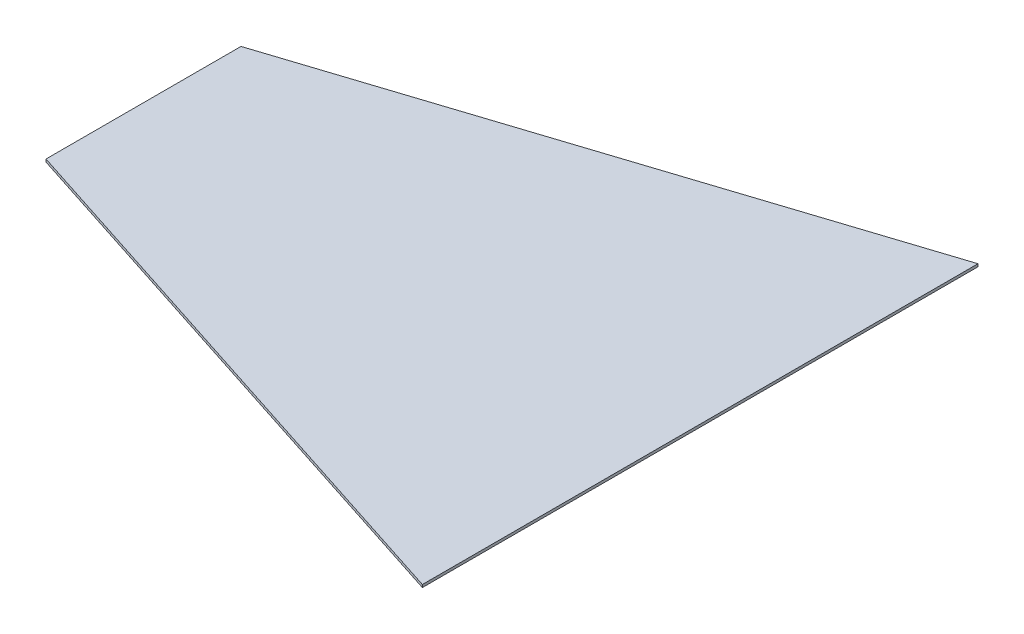
ISO-10303-21;
HEADER;
FILE_DESCRIPTION(('STEP AP214'),'2;1');
FILE_NAME('part.step','',(''),(''),'','','');
FILE_SCHEMA(('AUTOMOTIVE_DESIGN { 1 0 10303 214 1 1 1 1 }'));
ENDSEC;
DATA;
#1=APPLICATION_CONTEXT('core data for automotive mechanical design processes');
#2=APPLICATION_PROTOCOL_DEFINITION('international standard','automotive_design',2000,#1);
#3=PRODUCT_CONTEXT('',#1,'mechanical');
#4=PRODUCT('Part','Part','',(#3));
#5=PRODUCT_RELATED_PRODUCT_CATEGORY('part','',(#4));
#6=PRODUCT_DEFINITION_FORMATION('','',#4);
#7=PRODUCT_DEFINITION_CONTEXT('part definition',#1,'design');
#8=PRODUCT_DEFINITION('design','',#6,#7);
#9=PRODUCT_DEFINITION_SHAPE('','',#8);
#10=(LENGTH_UNIT() NAMED_UNIT(*) SI_UNIT(.MILLI.,.METRE.));
#11=(NAMED_UNIT(*) PLANE_ANGLE_UNIT() SI_UNIT($,.RADIAN.));
#12=(NAMED_UNIT(*) SI_UNIT($,.STERADIAN.) SOLID_ANGLE_UNIT());
#13=UNCERTAINTY_MEASURE_WITH_UNIT(LENGTH_MEASURE(1.E-05),#10,'distance_accuracy_value','');
#14=(GEOMETRIC_REPRESENTATION_CONTEXT(3) GLOBAL_UNCERTAINTY_ASSIGNED_CONTEXT((#13)) GLOBAL_UNIT_ASSIGNED_CONTEXT((#10,
#11,#12)) REPRESENTATION_CONTEXT('',''));
#15=CARTESIAN_POINT('',(0.,0.,0.));
#16=DIRECTION('',(0.,0.,1.));
#17=DIRECTION('',(1.,0.,0.));
#18=AXIS2_PLACEMENT_3D('',#15,#16,#17);
#19=CARTESIAN_POINT('',(-232.923242026266,2.54,-61.4746716697936));
#20=DIRECTION('',(1.,0.,0.));
#21=DIRECTION('',(0.,0.,-1.));
#22=AXIS2_PLACEMENT_3D('',#19,#20,#21);
#23=PLANE('',#22);
#24=DIRECTION('',(0.,0.,1.));
#25=VECTOR('',#24,1.);
#26=CARTESIAN_POINT('',(-232.923242026266,0.,-61.4746716697936));
#27=LINE('',#26,#25);
#28=CARTESIAN_POINT('',(-232.923242026266,0.,109.975328330206));
#29=VERTEX_POINT('',#28);
#30=CARTESIAN_POINT('',(-232.923242026266,0.,295.395328330206));
#31=VERTEX_POINT('',#30);
#32=EDGE_CURVE('E104',#29,#31,#27,.T.);
#33=ORIENTED_EDGE('',*,*,#32,.T.);
#34=DIRECTION('',(0.,1.,0.));
#35=VECTOR('',#34,1.);
#36=CARTESIAN_POINT('',(-232.923242026266,0.,295.395328330206));
#37=LINE('',#36,#35);
#38=CARTESIAN_POINT('',(-232.923242026266,2.54,295.395328330206));
#39=VERTEX_POINT('',#38);
#40=EDGE_CURVE('E54',#31,#39,#37,.T.);
#41=ORIENTED_EDGE('',*,*,#40,.T.);
#42=DIRECTION('',(0.,0.,1.));
#43=VECTOR('',#42,1.);
#44=CARTESIAN_POINT('',(-232.923242026266,2.54,-61.4746716697936));
#45=LINE('',#44,#43);
#46=CARTESIAN_POINT('',(-232.923242026266,2.54,109.975328330206));
#47=VERTEX_POINT('',#46);
#48=EDGE_CURVE('E91',#47,#39,#45,.T.);
#49=ORIENTED_EDGE('',*,*,#48,.F.);
#50=DIRECTION('',(0.,1.,0.));
#51=VECTOR('',#50,1.);
#52=CARTESIAN_POINT('',(-232.923242026266,0.,109.975328330206));
#53=LINE('',#52,#51);
#54=EDGE_CURVE('E93',#29,#47,#53,.T.);
#55=ORIENTED_EDGE('',*,*,#54,.F.);
#56=EDGE_LOOP('',(#33,#41,#49,#55));
#57=FACE_BOUND('',#56,.T.);
#58=ADVANCED_FACE('F39',(#57),#23,.F.);
#59=CARTESIAN_POINT('',(296.412757973734,2.54,-61.4746716697936));
#60=DIRECTION('',(-1.,0.,0.));
#61=DIRECTION('',(0.,0.,1.));
#62=AXIS2_PLACEMENT_3D('',#59,#60,#61);
#63=PLANE('',#62);
#64=DIRECTION('',(0.,0.,-1.));
#65=VECTOR('',#64,1.);
#66=CARTESIAN_POINT('',(296.412757973734,0.,-61.4746716697936));
#67=LINE('',#66,#65);
#68=CARTESIAN_POINT('',(296.412757973734,0.,466.845328330206));
#69=VERTEX_POINT('',#68);
#70=CARTESIAN_POINT('',(296.412757973734,0.,-61.4746716697936));
#71=VERTEX_POINT('',#70);
#72=EDGE_CURVE('E100',#69,#71,#67,.T.);
#73=ORIENTED_EDGE('',*,*,#72,.T.);
#74=DIRECTION('',(0.,-1.,0.));
#75=VECTOR('',#74,1.);
#76=CARTESIAN_POINT('',(296.412757973734,2.54,-61.4746716697936));
#77=LINE('',#76,#75);
#78=CARTESIAN_POINT('',(296.412757973734,2.54,-61.4746716697936));
#79=VERTEX_POINT('',#78);
#80=EDGE_CURVE('E47',#79,#71,#77,.T.);
#81=ORIENTED_EDGE('',*,*,#80,.F.);
#82=DIRECTION('',(0.,0.,-1.));
#83=VECTOR('',#82,1.);
#84=CARTESIAN_POINT('',(296.412757973734,2.54,-61.4746716697936));
#85=LINE('',#84,#83);
#86=CARTESIAN_POINT('',(296.412757973734,2.54,466.845328330206));
#87=VERTEX_POINT('',#86);
#88=EDGE_CURVE('E89',#87,#79,#85,.T.);
#89=ORIENTED_EDGE('',*,*,#88,.F.);
#90=DIRECTION('',(0.,-1.,0.));
#91=VECTOR('',#90,1.);
#92=CARTESIAN_POINT('',(296.412757973734,2.54,466.845328330206));
#93=LINE('',#92,#91);
#94=EDGE_CURVE('E11',#87,#69,#93,.T.);
#95=ORIENTED_EDGE('',*,*,#94,.T.);
#96=EDGE_LOOP('',(#73,#81,#89,#95));
#97=FACE_BOUND('',#96,.T.);
#98=ADVANCED_FACE('F95',(#97),#63,.F.);
#99=CARTESIAN_POINT('',(0.,2.54,0.));
#100=DIRECTION('',(0.,1.,0.));
#101=DIRECTION('',(0.,0.,1.));
#102=AXIS2_PLACEMENT_3D('',#99,#100,#101);
#103=PLANE('',#102);
#104=DIRECTION('',(-0.95134222763956,0.,-0.308136278146211));
#105=VECTOR('',#104,1.);
#106=CARTESIAN_POINT('',(296.412757973734,2.54,466.845328330206));
#107=LINE('',#106,#105);
#108=EDGE_CURVE('E78',#87,#39,#107,.T.);
#109=ORIENTED_EDGE('',*,*,#108,.F.);
#110=ORIENTED_EDGE('',*,*,#88,.T.);
#111=DIRECTION('',(0.95134222763956,0.,-0.308136278146211));
#112=VECTOR('',#111,1.);
#113=CARTESIAN_POINT('',(296.412757973734,2.54,-61.4746716697936));
#114=LINE('',#113,#112);
#115=EDGE_CURVE('E115',#47,#79,#114,.T.);
#116=ORIENTED_EDGE('',*,*,#115,.F.);
#117=ORIENTED_EDGE('',*,*,#48,.T.);
#118=EDGE_LOOP('',(#109,#110,#116,#117));
#119=FACE_BOUND('',#118,.T.);
#120=ADVANCED_FACE('F87',(#119),#103,.T.);
#121=CARTESIAN_POINT('',(0.,0.,0.));
#122=DIRECTION('',(0.,1.,0.));
#123=DIRECTION('',(0.,0.,1.));
#124=AXIS2_PLACEMENT_3D('',#121,#122,#123);
#125=PLANE('',#124);
#126=ORIENTED_EDGE('',*,*,#72,.F.);
#127=DIRECTION('',(-0.95134222763956,0.,-0.308136278146211));
#128=VECTOR('',#127,1.);
#129=CARTESIAN_POINT('',(296.412757973734,0.,466.845328330206));
#130=LINE('',#129,#128);
#131=EDGE_CURVE('E79',#69,#31,#130,.T.);
#132=ORIENTED_EDGE('',*,*,#131,.T.);
#133=ORIENTED_EDGE('',*,*,#32,.F.);
#134=DIRECTION('',(0.95134222763956,0.,-0.308136278146211));
#135=VECTOR('',#134,1.);
#136=CARTESIAN_POINT('',(296.412757973734,0.,-61.4746716697936));
#137=LINE('',#136,#135);
#138=EDGE_CURVE('E112',#29,#71,#137,.T.);
#139=ORIENTED_EDGE('',*,*,#138,.T.);
#140=EDGE_LOOP('',(#126,#132,#133,#139));
#141=FACE_BOUND('',#140,.T.);
#142=ADVANCED_FACE('F110',(#141),#125,.F.);
#143=CARTESIAN_POINT('',(296.412757973734,0.,-61.4746716697936));
#144=DIRECTION('',(0.308136278146211,0.,0.95134222763956));
#145=DIRECTION('',(0.95134222763956,0.,-0.308136278146211));
#146=AXIS2_PLACEMENT_3D('',#143,#144,#145);
#147=PLANE('',#146);
#148=ORIENTED_EDGE('',*,*,#115,.T.);
#149=ORIENTED_EDGE('',*,*,#80,.T.);
#150=ORIENTED_EDGE('',*,*,#138,.F.);
#151=ORIENTED_EDGE('',*,*,#54,.T.);
#152=EDGE_LOOP('',(#148,#149,#150,#151));
#153=FACE_BOUND('',#152,.T.);
#154=ADVANCED_FACE('F125',(#153),#147,.F.);
#155=CARTESIAN_POINT('',(296.412757973734,0.,466.845328330206));
#156=DIRECTION('',(0.308136278146211,0.,-0.95134222763956));
#157=DIRECTION('',(-0.95134222763956,0.,-0.308136278146211));
#158=AXIS2_PLACEMENT_3D('',#155,#156,#157);
#159=PLANE('',#158);
#160=ORIENTED_EDGE('',*,*,#108,.T.);
#161=ORIENTED_EDGE('',*,*,#40,.F.);
#162=ORIENTED_EDGE('',*,*,#131,.F.);
#163=ORIENTED_EDGE('',*,*,#94,.F.);
#164=EDGE_LOOP('',(#160,#161,#162,#163));
#165=FACE_BOUND('',#164,.T.);
#166=ADVANCED_FACE('F77',(#165),#159,.F.);
#167=CLOSED_SHELL('',(#58,#98,#120,#142,#154,#166));
#168=MANIFOLD_SOLID_BREP('B2',#167);
#169=ADVANCED_BREP_SHAPE_REPRESENTATION('',(#18,#168),#14);
#170=SHAPE_DEFINITION_REPRESENTATION(#9,#169);
ENDSEC;
END-ISO-10303-21;
